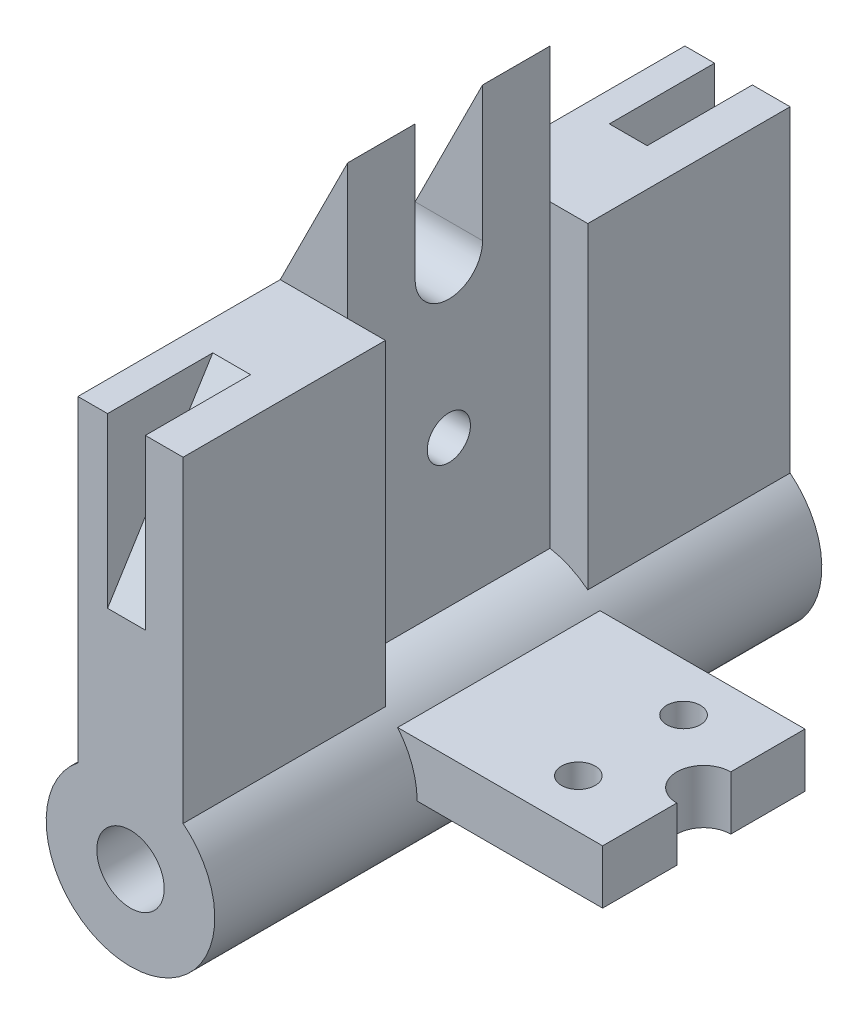
ISO-10303-21;
HEADER;
FILE_DESCRIPTION(('STEP AP214'),'2;1');
FILE_NAME('part.step','',(''),(''),'','','');
FILE_SCHEMA(('AUTOMOTIVE_DESIGN { 1 0 10303 214 1 1 1 1 }'));
ENDSEC;
DATA;
#1=APPLICATION_CONTEXT('core data for automotive mechanical design processes');
#2=APPLICATION_PROTOCOL_DEFINITION('international standard','automotive_design',2000,#1);
#3=PRODUCT_CONTEXT('',#1,'mechanical');
#4=PRODUCT('Part','Part','',(#3));
#5=PRODUCT_RELATED_PRODUCT_CATEGORY('part','',(#4));
#6=PRODUCT_DEFINITION_FORMATION('','',#4);
#7=PRODUCT_DEFINITION_CONTEXT('part definition',#1,'design');
#8=PRODUCT_DEFINITION('design','',#6,#7);
#9=PRODUCT_DEFINITION_SHAPE('','',#8);
#10=(LENGTH_UNIT() NAMED_UNIT(*) SI_UNIT(.MILLI.,.METRE.));
#11=(NAMED_UNIT(*) PLANE_ANGLE_UNIT() SI_UNIT($,.RADIAN.));
#12=(NAMED_UNIT(*) SI_UNIT($,.STERADIAN.) SOLID_ANGLE_UNIT());
#13=UNCERTAINTY_MEASURE_WITH_UNIT(LENGTH_MEASURE(1.E-05),#10,'distance_accuracy_value','');
#14=(GEOMETRIC_REPRESENTATION_CONTEXT(3) GLOBAL_UNCERTAINTY_ASSIGNED_CONTEXT((#13)) GLOBAL_UNIT_ASSIGNED_CONTEXT((#10,
#11,#12)) REPRESENTATION_CONTEXT('',''));
#15=CARTESIAN_POINT('',(0.,0.,0.));
#16=DIRECTION('',(0.,0.,1.));
#17=DIRECTION('',(1.,0.,0.));
#18=AXIS2_PLACEMENT_3D('',#15,#16,#17);
#19=CARTESIAN_POINT('',(50.8,0.,19.05));
#20=DIRECTION('',(-1.,0.,0.));
#21=DIRECTION('',(0.,0.,1.));
#22=AXIS2_PLACEMENT_3D('',#19,#20,#21);
#23=PLANE('',#22);
#24=DIRECTION('',(0.,0.,-1.));
#25=VECTOR('',#24,1.);
#26=CARTESIAN_POINT('',(50.8,0.,19.05));
#27=LINE('',#26,#25);
#28=CARTESIAN_POINT('',(50.8,0.,19.05));
#29=VERTEX_POINT('',#28);
#30=CARTESIAN_POINT('',(50.8,0.,5.08000000000001));
#31=VERTEX_POINT('',#30);
#32=EDGE_CURVE('E211',#29,#31,#27,.T.);
#33=ORIENTED_EDGE('',*,*,#32,.T.);
#34=DIRECTION('',(0.,1.,0.));
#35=VECTOR('',#34,1.);
#36=CARTESIAN_POINT('',(50.8,-15.875,5.08000000000001));
#37=LINE('',#36,#35);
#38=CARTESIAN_POINT('',(50.8,10.16,5.08000000000001));
#39=VERTEX_POINT('',#38);
#40=EDGE_CURVE('E199',#31,#39,#37,.T.);
#41=ORIENTED_EDGE('',*,*,#40,.T.);
#42=DIRECTION('',(0.,0.,-1.));
#43=VECTOR('',#42,1.);
#44=CARTESIAN_POINT('',(50.8,10.16,19.05));
#45=LINE('',#44,#43);
#46=CARTESIAN_POINT('',(50.8,10.16,19.05));
#47=VERTEX_POINT('',#46);
#48=EDGE_CURVE('E208',#47,#39,#45,.T.);
#49=ORIENTED_EDGE('',*,*,#48,.F.);
#50=DIRECTION('',(0.,1.,0.));
#51=VECTOR('',#50,1.);
#52=CARTESIAN_POINT('',(50.8,0.,19.05));
#53=LINE('',#52,#51);
#54=EDGE_CURVE('E250',#29,#47,#53,.T.);
#55=ORIENTED_EDGE('',*,*,#54,.F.);
#56=EDGE_LOOP('',(#33,#41,#49,#55));
#57=FACE_BOUND('',#56,.T.);
#58=ADVANCED_FACE('F34',(#57),#23,.F.);
#59=CARTESIAN_POINT('',(2.794,0.,19.05));
#60=DIRECTION('',(-1.,0.,0.));
#61=DIRECTION('',(0.,0.,1.));
#62=AXIS2_PLACEMENT_3D('',#59,#60,#61);
#63=PLANE('',#62);
#64=CARTESIAN_POINT('',(2.794,43.18,0.));
#65=DIRECTION('',(1.,0.,0.));
#66=DIRECTION('',(0.,0.,-1.));
#67=AXIS2_PLACEMENT_3D('',#64,#65,#66);
#68=CIRCLE('',#67,4.064);
#69=CARTESIAN_POINT('',(2.794,43.18,-4.064));
#70=VERTEX_POINT('',#69);
#71=EDGE_CURVE('E318',#70,#70,#68,.T.);
#72=ORIENTED_EDGE('',*,*,#71,.F.);
#73=EDGE_LOOP('',(#72));
#74=FACE_BOUND('',#73,.T.);
#75=DIRECTION('',(0.,1.,0.));
#76=VECTOR('',#75,1.);
#77=CARTESIAN_POINT('',(2.794,0.,6.35));
#78=LINE('',#77,#76);
#79=CARTESIAN_POINT('',(2.794,72.136,6.35));
#80=VERTEX_POINT('',#79);
#81=CARTESIAN_POINT('',(2.794,97.536,6.35));
#82=VERTEX_POINT('',#81);
#83=EDGE_CURVE('E317',#80,#82,#78,.T.);
#84=ORIENTED_EDGE('',*,*,#83,.T.);
#85=DIRECTION('',(0.,0.,-1.));
#86=VECTOR('',#85,1.);
#87=CARTESIAN_POINT('',(2.794,97.536,19.05));
#88=LINE('',#87,#86);
#89=CARTESIAN_POINT('',(2.794,97.536,19.05));
#90=VERTEX_POINT('',#89);
#91=EDGE_CURVE('E235',#90,#82,#88,.T.);
#92=ORIENTED_EDGE('',*,*,#91,.F.);
#93=DIRECTION('',(0.,1.,0.));
#94=VECTOR('',#93,1.);
#95=CARTESIAN_POINT('',(2.794,0.,19.05));
#96=LINE('',#95,#94);
#97=CARTESIAN_POINT('',(2.794,72.136,19.05));
#98=VERTEX_POINT('',#97);
#99=EDGE_CURVE('E266',#98,#90,#96,.T.);
#100=ORIENTED_EDGE('',*,*,#99,.F.);
#101=CARTESIAN_POINT('',(2.79400000000001,15.6271938939785,19.05));
#102=VERTEX_POINT('',#101);
#103=EDGE_CURVE('E412',#102,#98,#96,.T.);
#104=ORIENTED_EDGE('',*,*,#103,.F.);
#105=DIRECTION('',(0.,0.,-1.));
#106=VECTOR('',#105,1.);
#107=CARTESIAN_POINT('',(2.79400000000001,15.6271938939785,19.05));
#108=LINE('',#107,#106);
#109=CARTESIAN_POINT('',(2.79400000000001,15.6271938939785,-19.05));
#110=VERTEX_POINT('',#109);
#111=EDGE_CURVE('E224',#102,#110,#108,.T.);
#112=ORIENTED_EDGE('',*,*,#111,.T.);
#113=DIRECTION('',(0.,1.,0.));
#114=VECTOR('',#113,1.);
#115=CARTESIAN_POINT('',(2.794,0.,-19.05));
#116=LINE('',#115,#114);
#117=CARTESIAN_POINT('',(2.794,72.136,-19.05));
#118=VERTEX_POINT('',#117);
#119=EDGE_CURVE('E253',#110,#118,#116,.T.);
#120=ORIENTED_EDGE('',*,*,#119,.T.);
#121=CARTESIAN_POINT('',(2.794,97.536,-19.05));
#122=VERTEX_POINT('',#121);
#123=EDGE_CURVE('E256',#118,#122,#116,.T.);
#124=ORIENTED_EDGE('',*,*,#123,.T.);
#125=CARTESIAN_POINT('',(2.794,97.536,-6.35));
#126=VERTEX_POINT('',#125);
#127=EDGE_CURVE('E234',#126,#122,#88,.T.);
#128=ORIENTED_EDGE('',*,*,#127,.F.);
#129=DIRECTION('',(0.,1.,0.));
#130=VECTOR('',#129,1.);
#131=CARTESIAN_POINT('',(2.794,0.,-6.35));
#132=LINE('',#131,#130);
#133=CARTESIAN_POINT('',(2.794,72.136,-6.35));
#134=VERTEX_POINT('',#133);
#135=EDGE_CURVE('E335',#134,#126,#132,.T.);
#136=ORIENTED_EDGE('',*,*,#135,.F.);
#137=CARTESIAN_POINT('',(2.794,72.136,0.));
#138=DIRECTION('',(1.,0.,0.));
#139=DIRECTION('',(0.,0.,-1.));
#140=AXIS2_PLACEMENT_3D('',#137,#138,#139);
#141=CIRCLE('',#140,6.35);
#142=EDGE_CURVE('E322',#80,#134,#141,.T.);
#143=ORIENTED_EDGE('',*,*,#142,.F.);
#144=EDGE_LOOP('',(#84,#92,#100,#104,#112,#120,#124,#128,#136,#143));
#145=FACE_BOUND('',#144,.T.);
#146=ADVANCED_FACE('F36',(#74,#145),#63,.F.);
#147=CARTESIAN_POINT('',(-36.7792,18.3896,19.05));
#148=DIRECTION('',(0.894427190999916,-0.447213595499958,0.));
#149=DIRECTION('',(0.447213595499958,0.894427190999916,0.));
#150=AXIS2_PLACEMENT_3D('',#147,#148,#149);
#151=PLANE('',#150);
#152=DIRECTION('',(0.447213595499958,0.894427190999916,0.));
#153=VECTOR('',#152,1.);
#154=CARTESIAN_POINT('',(-36.7792,18.3896,6.35));
#155=LINE('',#154,#153);
#156=CARTESIAN_POINT('',(-9.906,72.136,6.35));
#157=VERTEX_POINT('',#156);
#158=EDGE_CURVE('E42',#157,#82,#155,.T.);
#159=ORIENTED_EDGE('',*,*,#158,.F.);
#160=DIRECTION('',(0.,0.,-1.));
#161=VECTOR('',#160,1.);
#162=CARTESIAN_POINT('',(-9.906,72.136,19.05));
#163=LINE('',#162,#161);
#164=CARTESIAN_POINT('',(-9.906,72.136,19.05));
#165=VERTEX_POINT('',#164);
#166=EDGE_CURVE('E231',#165,#157,#163,.T.);
#167=ORIENTED_EDGE('',*,*,#166,.F.);
#168=DIRECTION('',(-0.447213595499958,-0.894427190999916,0.));
#169=VECTOR('',#168,1.);
#170=CARTESIAN_POINT('',(-36.7792,18.3896,19.05));
#171=LINE('',#170,#169);
#172=EDGE_CURVE('E248',#90,#165,#171,.T.);
#173=ORIENTED_EDGE('',*,*,#172,.F.);
#174=ORIENTED_EDGE('',*,*,#91,.T.);
#175=EDGE_LOOP('',(#159,#167,#173,#174));
#176=FACE_BOUND('',#175,.T.);
#177=ADVANCED_FACE('F427',(#176),#151,.F.);
#178=CARTESIAN_POINT('',(0.,72.136,-57.15));
#179=DIRECTION('',(0.,-1.,0.));
#180=DIRECTION('',(0.,0.,-1.));
#181=AXIS2_PLACEMENT_3D('',#178,#179,#180);
#182=PLANE('',#181);
#183=DIRECTION('',(0.,0.,1.));
#184=VECTOR('',#183,1.);
#185=CARTESIAN_POINT('',(2.794,72.136,-37.338));
#186=LINE('',#185,#184);
#187=CARTESIAN_POINT('',(2.794,72.136,-57.15));
#188=VERTEX_POINT('',#187);
#189=CARTESIAN_POINT('',(2.794,72.136,-37.338));
#190=VERTEX_POINT('',#189);
#191=EDGE_CURVE('E346',#188,#190,#186,.T.);
#192=ORIENTED_EDGE('',*,*,#191,.T.);
#193=DIRECTION('',(-1.,0.,0.));
#194=VECTOR('',#193,1.);
#195=CARTESIAN_POINT('',(-4.318,72.136,-37.338));
#196=LINE('',#195,#194);
#197=CARTESIAN_POINT('',(-4.318,72.136,-37.338));
#198=VERTEX_POINT('',#197);
#199=EDGE_CURVE('E343',#190,#198,#196,.T.);
#200=ORIENTED_EDGE('',*,*,#199,.T.);
#201=DIRECTION('',(0.,0.,-1.));
#202=VECTOR('',#201,1.);
#203=CARTESIAN_POINT('',(-4.318,72.136,-57.15));
#204=LINE('',#203,#202);
#205=CARTESIAN_POINT('',(-4.318,72.136,-57.15));
#206=VERTEX_POINT('',#205);
#207=EDGE_CURVE('E339',#198,#206,#204,.T.);
#208=ORIENTED_EDGE('',*,*,#207,.T.);
#209=DIRECTION('',(1.,0.,0.));
#210=VECTOR('',#209,1.);
#211=CARTESIAN_POINT('',(0.,72.136,-57.15));
#212=LINE('',#211,#210);
#213=CARTESIAN_POINT('',(-9.906,72.136,-57.15));
#214=VERTEX_POINT('',#213);
#215=EDGE_CURVE('E375',#214,#206,#212,.T.);
#216=ORIENTED_EDGE('',*,*,#215,.F.);
#217=DIRECTION('',(0.,0.,1.));
#218=VECTOR('',#217,1.);
#219=CARTESIAN_POINT('',(-9.906,72.136,-57.15));
#220=LINE('',#219,#218);
#221=CARTESIAN_POINT('',(-9.906,72.136,-19.05));
#222=VERTEX_POINT('',#221);
#223=EDGE_CURVE('E382',#214,#222,#220,.T.);
#224=ORIENTED_EDGE('',*,*,#223,.T.);
#225=DIRECTION('',(1.,0.,0.));
#226=VECTOR('',#225,1.);
#227=CARTESIAN_POINT('',(0.,72.136,-19.05));
#228=LINE('',#227,#226);
#229=EDGE_CURVE('E368',#222,#118,#228,.T.);
#230=ORIENTED_EDGE('',*,*,#229,.T.);
#231=CARTESIAN_POINT('',(9.906,72.136,-19.05));
#232=VERTEX_POINT('',#231);
#233=EDGE_CURVE('E293',#118,#232,#228,.T.);
#234=ORIENTED_EDGE('',*,*,#233,.T.);
#235=DIRECTION('',(0.,0.,1.));
#236=VECTOR('',#235,1.);
#237=CARTESIAN_POINT('',(9.906,72.136,-57.15));
#238=LINE('',#237,#236);
#239=CARTESIAN_POINT('',(9.906,72.136,-57.15));
#240=VERTEX_POINT('',#239);
#241=EDGE_CURVE('E286',#240,#232,#238,.T.);
#242=ORIENTED_EDGE('',*,*,#241,.F.);
#243=EDGE_CURVE('E374',#188,#240,#212,.T.);
#244=ORIENTED_EDGE('',*,*,#243,.F.);
#245=EDGE_LOOP('',(#192,#200,#208,#216,#224,#230,#234,#242,#244));
#246=FACE_BOUND('',#245,.T.);
#247=ADVANCED_FACE('F520',(#246),#182,.F.);
#248=CARTESIAN_POINT('',(0.,0.,-57.15));
#249=DIRECTION('',(0.,0.,1.));
#250=DIRECTION('',(1.,0.,0.));
#251=AXIS2_PLACEMENT_3D('',#248,#249,#250);
#252=PLANE('',#251);
#253=CARTESIAN_POINT('',(0.,0.,-57.15));
#254=DIRECTION('',(0.,0.,1.));
#255=DIRECTION('',(1.,0.,0.));
#256=AXIS2_PLACEMENT_3D('',#253,#254,#255);
#257=CIRCLE('',#256,6.35);
#258=CARTESIAN_POINT('',(-6.35,0.,-57.15));
#259=VERTEX_POINT('',#258);
#260=EDGE_CURVE('E287',#259,#259,#257,.T.);
#261=ORIENTED_EDGE('',*,*,#260,.T.);
#262=EDGE_LOOP('',(#261));
#263=FACE_BOUND('',#262,.T.);
#264=DIRECTION('',(0.,-1.,0.));
#265=VECTOR('',#264,1.);
#266=CARTESIAN_POINT('',(2.79399999999999,0.,-57.15));
#267=LINE('',#266,#265);
#268=CARTESIAN_POINT('',(2.794,40.386,-57.15));
#269=VERTEX_POINT('',#268);
#270=EDGE_CURVE('E308',#188,#269,#267,.T.);
#271=ORIENTED_EDGE('',*,*,#270,.F.);
#272=ORIENTED_EDGE('',*,*,#243,.T.);
#273=DIRECTION('',(0.,1.,0.));
#274=VECTOR('',#273,1.);
#275=CARTESIAN_POINT('',(9.906,0.,-57.15));
#276=LINE('',#275,#274);
#277=CARTESIAN_POINT('',(9.906,12.4051114061906,-57.15));
#278=VERTEX_POINT('',#277);
#279=EDGE_CURVE('E371',#278,#240,#276,.T.);
#280=ORIENTED_EDGE('',*,*,#279,.F.);
#281=CARTESIAN_POINT('',(0.,0.,-57.15));
#282=DIRECTION('',(0.,0.,1.));
#283=DIRECTION('',(1.,0.,0.));
#284=AXIS2_PLACEMENT_3D('',#281,#282,#283);
#285=CIRCLE('',#284,15.875);
#286=CARTESIAN_POINT('',(-9.906,12.4051114061906,-57.15));
#287=VERTEX_POINT('',#286);
#288=EDGE_CURVE('E367',#287,#278,#285,.T.);
#289=ORIENTED_EDGE('',*,*,#288,.F.);
#290=DIRECTION('',(0.,1.,0.));
#291=VECTOR('',#290,1.);
#292=CARTESIAN_POINT('',(-9.906,0.,-57.15));
#293=LINE('',#292,#291);
#294=EDGE_CURVE('E364',#287,#214,#293,.T.);
#295=ORIENTED_EDGE('',*,*,#294,.T.);
#296=ORIENTED_EDGE('',*,*,#215,.T.);
#297=DIRECTION('',(0.,1.,0.));
#298=VECTOR('',#297,1.);
#299=CARTESIAN_POINT('',(-4.318,0.,-57.15));
#300=LINE('',#299,#298);
#301=CARTESIAN_POINT('',(-4.318,40.386,-57.15));
#302=VERTEX_POINT('',#301);
#303=EDGE_CURVE('E303',#302,#206,#300,.T.);
#304=ORIENTED_EDGE('',*,*,#303,.F.);
#305=DIRECTION('',(-1.,0.,0.));
#306=VECTOR('',#305,1.);
#307=CARTESIAN_POINT('',(0.,40.386,-57.15));
#308=LINE('',#307,#306);
#309=EDGE_CURVE('E305',#269,#302,#308,.T.);
#310=ORIENTED_EDGE('',*,*,#309,.F.);
#311=EDGE_LOOP('',(#271,#272,#280,#289,#295,#296,#304,#310));
#312=FACE_BOUND('',#311,.T.);
#313=ADVANCED_FACE('F524',(#263,#312),#252,.F.);
#314=CARTESIAN_POINT('',(0.,0.,-19.05));
#315=DIRECTION('',(0.,0.,1.));
#316=DIRECTION('',(1.,0.,0.));
#317=AXIS2_PLACEMENT_3D('',#314,#315,#316);
#318=PLANE('',#317);
#319=ORIENTED_EDGE('',*,*,#229,.F.);
#320=DIRECTION('',(-0.447213595499958,-0.894427190999916,0.));
#321=VECTOR('',#320,1.);
#322=CARTESIAN_POINT('',(-36.7792,18.3896,-19.05));
#323=LINE('',#322,#321);
#324=EDGE_CURVE('E255',#122,#222,#323,.T.);
#325=ORIENTED_EDGE('',*,*,#324,.F.);
#326=ORIENTED_EDGE('',*,*,#123,.F.);
#327=EDGE_LOOP('',(#319,#325,#326));
#328=FACE_BOUND('',#327,.T.);
#329=ADVANCED_FACE('F517',(#328),#318,.F.);
#330=CARTESIAN_POINT('',(0.,0.,19.05));
#331=DIRECTION('',(0.,0.,1.));
#332=DIRECTION('',(1.,0.,0.));
#333=AXIS2_PLACEMENT_3D('',#330,#331,#332);
#334=PLANE('',#333);
#335=ORIENTED_EDGE('',*,*,#172,.T.);
#336=DIRECTION('',(1.,0.,0.));
#337=VECTOR('',#336,1.);
#338=CARTESIAN_POINT('',(0.,72.136,19.05));
#339=LINE('',#338,#337);
#340=EDGE_CURVE('E392',#165,#98,#339,.T.);
#341=ORIENTED_EDGE('',*,*,#340,.T.);
#342=ORIENTED_EDGE('',*,*,#99,.T.);
#343=EDGE_LOOP('',(#335,#341,#342));
#344=FACE_BOUND('',#343,.T.);
#345=ADVANCED_FACE('F420',(#344),#334,.T.);
#346=CARTESIAN_POINT('',(-9.906,72.136,-6.35));
#347=VERTEX_POINT('',#346);
#348=EDGE_CURVE('E230',#347,#222,#163,.T.);
#349=ORIENTED_EDGE('',*,*,#348,.F.);
#350=DIRECTION('',(0.447213595499958,0.894427190999916,0.));
#351=VECTOR('',#350,1.);
#352=CARTESIAN_POINT('',(-36.7792,18.3896,-6.35));
#353=LINE('',#352,#351);
#354=EDGE_CURVE('E312',#347,#126,#353,.T.);
#355=ORIENTED_EDGE('',*,*,#354,.T.);
#356=ORIENTED_EDGE('',*,*,#127,.T.);
#357=ORIENTED_EDGE('',*,*,#324,.T.);
#358=EDGE_LOOP('',(#349,#355,#356,#357));
#359=FACE_BOUND('',#358,.T.);
#360=ADVANCED_FACE('F510',(#359),#151,.F.);
#361=CARTESIAN_POINT('',(-9.906,0.,19.05));
#362=DIRECTION('',(-1.,0.,0.));
#363=DIRECTION('',(0.,0.,1.));
#364=AXIS2_PLACEMENT_3D('',#361,#362,#363);
#365=PLANE('',#364);
#366=CARTESIAN_POINT('',(-9.906,43.18,0.));
#367=DIRECTION('',(-1.,0.,0.));
#368=DIRECTION('',(0.,0.,1.));
#369=AXIS2_PLACEMENT_3D('',#366,#367,#368);
#370=CIRCLE('',#369,4.064);
#371=CARTESIAN_POINT('',(-9.906,43.18,4.064));
#372=VERTEX_POINT('',#371);
#373=EDGE_CURVE('E315',#372,#372,#370,.T.);
#374=ORIENTED_EDGE('',*,*,#373,.F.);
#375=EDGE_LOOP('',(#374));
#376=FACE_BOUND('',#375,.T.);
#377=CARTESIAN_POINT('',(-9.906,72.136,0.));
#378=DIRECTION('',(-1.,0.,0.));
#379=DIRECTION('',(0.,0.,1.));
#380=AXIS2_PLACEMENT_3D('',#377,#378,#379);
#381=CIRCLE('',#380,6.35);
#382=EDGE_CURVE('E310',#347,#157,#381,.T.);
#383=ORIENTED_EDGE('',*,*,#382,.F.);
#384=ORIENTED_EDGE('',*,*,#348,.T.);
#385=ORIENTED_EDGE('',*,*,#223,.F.);
#386=ORIENTED_EDGE('',*,*,#294,.F.);
#387=DIRECTION('',(0.,0.,-1.));
#388=VECTOR('',#387,1.);
#389=CARTESIAN_POINT('',(-9.906,12.4051114061906,19.05));
#390=LINE('',#389,#388);
#391=CARTESIAN_POINT('',(-9.906,12.4051114061906,57.15));
#392=VERTEX_POINT('',#391);
#393=EDGE_CURVE('E228',#392,#287,#390,.T.);
#394=ORIENTED_EDGE('',*,*,#393,.F.);
#395=DIRECTION('',(0.,1.,0.));
#396=VECTOR('',#395,1.);
#397=CARTESIAN_POINT('',(-9.906,0.,57.15));
#398=LINE('',#397,#396);
#399=CARTESIAN_POINT('',(-9.906,72.136,57.15));
#400=VERTEX_POINT('',#399);
#401=EDGE_CURVE('E388',#392,#400,#398,.T.);
#402=ORIENTED_EDGE('',*,*,#401,.T.);
#403=DIRECTION('',(0.,0.,-1.));
#404=VECTOR('',#403,1.);
#405=CARTESIAN_POINT('',(-9.906,72.136,57.15));
#406=LINE('',#405,#404);
#407=EDGE_CURVE('E404',#400,#165,#406,.T.);
#408=ORIENTED_EDGE('',*,*,#407,.T.);
#409=ORIENTED_EDGE('',*,*,#166,.T.);
#410=EDGE_LOOP('',(#383,#384,#385,#386,#394,#402,#408,#409));
#411=FACE_BOUND('',#410,.T.);
#412=ADVANCED_FACE('F436',(#376,#411),#365,.T.);
#413=CARTESIAN_POINT('',(0.,0.,19.05));
#414=DIRECTION('',(0.,1.,0.));
#415=DIRECTION('',(-1.,0.,0.));
#416=AXIS2_PLACEMENT_3D('',#413,#414,#415);
#417=PLANE('',#416);
#418=CARTESIAN_POINT('',(37.084,0.,-9.906));
#419=DIRECTION('',(0.,1.,0.));
#420=DIRECTION('',(-1.,0.,0.));
#421=AXIS2_PLACEMENT_3D('',#418,#419,#420);
#422=CIRCLE('',#421,3.175);
#423=CARTESIAN_POINT('',(33.909,0.,-9.906));
#424=VERTEX_POINT('',#423);
#425=EDGE_CURVE('E477',#424,#424,#422,.T.);
#426=ORIENTED_EDGE('',*,*,#425,.T.);
#427=EDGE_LOOP('',(#426));
#428=FACE_BOUND('',#427,.T.);
#429=CARTESIAN_POINT('',(37.084,0.,9.906));
#430=DIRECTION('',(0.,1.,0.));
#431=DIRECTION('',(-1.,0.,0.));
#432=AXIS2_PLACEMENT_3D('',#429,#430,#431);
#433=CIRCLE('',#432,3.175);
#434=CARTESIAN_POINT('',(33.909,0.,9.906));
#435=VERTEX_POINT('',#434);
#436=EDGE_CURVE('E325',#435,#435,#433,.T.);
#437=ORIENTED_EDGE('',*,*,#436,.T.);
#438=EDGE_LOOP('',(#437));
#439=FACE_BOUND('',#438,.T.);
#440=CARTESIAN_POINT('',(50.8,0.,-5.08));
#441=VERTEX_POINT('',#440);
#442=CARTESIAN_POINT('',(50.8,0.,-19.05));
#443=VERTEX_POINT('',#442);
#444=EDGE_CURVE('E218',#441,#443,#27,.T.);
#445=ORIENTED_EDGE('',*,*,#444,.F.);
#446=CARTESIAN_POINT('',(50.8,0.,0.));
#447=DIRECTION('',(0.,1.,0.));
#448=DIRECTION('',(-1.,0.,0.));
#449=AXIS2_PLACEMENT_3D('',#446,#447,#448);
#450=CIRCLE('',#449,5.08);
#451=EDGE_CURVE('E213',#441,#31,#450,.T.);
#452=ORIENTED_EDGE('',*,*,#451,.T.);
#453=ORIENTED_EDGE('',*,*,#32,.F.);
#454=DIRECTION('',(1.,0.,0.));
#455=VECTOR('',#454,1.);
#456=CARTESIAN_POINT('',(0.,0.,19.05));
#457=LINE('',#456,#455);
#458=CARTESIAN_POINT('',(15.875,0.,19.05));
#459=VERTEX_POINT('',#458);
#460=EDGE_CURVE('E252',#459,#29,#457,.T.);
#461=ORIENTED_EDGE('',*,*,#460,.F.);
#462=DIRECTION('',(0.,0.,-1.));
#463=VECTOR('',#462,1.);
#464=CARTESIAN_POINT('',(15.875,0.,19.05));
#465=LINE('',#464,#463);
#466=CARTESIAN_POINT('',(15.875,0.,-19.05));
#467=VERTEX_POINT('',#466);
#468=EDGE_CURVE('E227',#459,#467,#465,.T.);
#469=ORIENTED_EDGE('',*,*,#468,.T.);
#470=DIRECTION('',(1.,0.,0.));
#471=VECTOR('',#470,1.);
#472=CARTESIAN_POINT('',(0.,0.,-19.05));
#473=LINE('',#472,#471);
#474=EDGE_CURVE('E259',#467,#443,#473,.T.);
#475=ORIENTED_EDGE('',*,*,#474,.T.);
#476=EDGE_LOOP('',(#445,#452,#453,#461,#469,#475));
#477=FACE_BOUND('',#476,.T.);
#478=ADVANCED_FACE('F471',(#428,#439,#477),#417,.F.);
#479=CARTESIAN_POINT('',(50.8,10.16,-5.08));
#480=VERTEX_POINT('',#479);
#481=CARTESIAN_POINT('',(50.8,10.16,-19.05));
#482=VERTEX_POINT('',#481);
#483=EDGE_CURVE('E219',#480,#482,#45,.T.);
#484=ORIENTED_EDGE('',*,*,#483,.F.);
#485=DIRECTION('',(0.,1.,0.));
#486=VECTOR('',#485,1.);
#487=CARTESIAN_POINT('',(50.8,-15.875,-5.08));
#488=LINE('',#487,#486);
#489=EDGE_CURVE('E49',#480,#441,#488,.F.);
#490=ORIENTED_EDGE('',*,*,#489,.T.);
#491=ORIENTED_EDGE('',*,*,#444,.T.);
#492=DIRECTION('',(0.,1.,0.));
#493=VECTOR('',#492,1.);
#494=CARTESIAN_POINT('',(50.8,0.,-19.05));
#495=LINE('',#494,#493);
#496=EDGE_CURVE('E261',#443,#482,#495,.T.);
#497=ORIENTED_EDGE('',*,*,#496,.T.);
#498=EDGE_LOOP('',(#484,#490,#491,#497));
#499=FACE_BOUND('',#498,.T.);
#500=ADVANCED_FACE('F487',(#499),#23,.F.);
#501=CARTESIAN_POINT('',(0.,10.16,19.05));
#502=DIRECTION('',(0.,-1.,0.));
#503=DIRECTION('',(1.,0.,0.));
#504=AXIS2_PLACEMENT_3D('',#501,#502,#503);
#505=PLANE('',#504);
#506=CARTESIAN_POINT('',(37.084,10.16,-9.906));
#507=DIRECTION('',(0.,1.,0.));
#508=DIRECTION('',(-1.,0.,0.));
#509=AXIS2_PLACEMENT_3D('',#506,#507,#508);
#510=CIRCLE('',#509,3.175);
#511=CARTESIAN_POINT('',(33.909,10.16,-9.906));
#512=VERTEX_POINT('',#511);
#513=EDGE_CURVE('E212',#512,#512,#510,.T.);
#514=ORIENTED_EDGE('',*,*,#513,.F.);
#515=EDGE_LOOP('',(#514));
#516=FACE_BOUND('',#515,.T.);
#517=CARTESIAN_POINT('',(37.084,10.16,9.906));
#518=DIRECTION('',(0.,1.,0.));
#519=DIRECTION('',(-1.,0.,0.));
#520=AXIS2_PLACEMENT_3D('',#517,#518,#519);
#521=CIRCLE('',#520,3.175);
#522=CARTESIAN_POINT('',(33.909,10.16,9.906));
#523=VERTEX_POINT('',#522);
#524=EDGE_CURVE('E330',#523,#523,#521,.T.);
#525=ORIENTED_EDGE('',*,*,#524,.F.);
#526=EDGE_LOOP('',(#525));
#527=FACE_BOUND('',#526,.T.);
#528=ORIENTED_EDGE('',*,*,#48,.T.);
#529=CARTESIAN_POINT('',(50.8,10.16,0.));
#530=DIRECTION('',(0.,-1.,0.));
#531=DIRECTION('',(1.,0.,0.));
#532=AXIS2_PLACEMENT_3D('',#529,#530,#531);
#533=CIRCLE('',#532,5.08);
#534=EDGE_CURVE('E11',#39,#480,#533,.T.);
#535=ORIENTED_EDGE('',*,*,#534,.T.);
#536=ORIENTED_EDGE('',*,*,#483,.T.);
#537=DIRECTION('',(-1.,0.,0.));
#538=VECTOR('',#537,1.);
#539=CARTESIAN_POINT('',(0.,10.16,-19.05));
#540=LINE('',#539,#538);
#541=CARTESIAN_POINT('',(12.1979516723096,10.16,-19.05));
#542=VERTEX_POINT('',#541);
#543=EDGE_CURVE('E267',#482,#542,#540,.T.);
#544=ORIENTED_EDGE('',*,*,#543,.T.);
#545=DIRECTION('',(0.,0.,-1.));
#546=VECTOR('',#545,1.);
#547=CARTESIAN_POINT('',(12.1979516723096,10.16,19.05));
#548=LINE('',#547,#546);
#549=CARTESIAN_POINT('',(12.1979516723096,10.16,19.05));
#550=VERTEX_POINT('',#549);
#551=EDGE_CURVE('E222',#550,#542,#548,.T.);
#552=ORIENTED_EDGE('',*,*,#551,.F.);
#553=DIRECTION('',(-1.,0.,0.));
#554=VECTOR('',#553,1.);
#555=CARTESIAN_POINT('',(0.,10.16,19.05));
#556=LINE('',#555,#554);
#557=EDGE_CURVE('E217',#47,#550,#556,.T.);
#558=ORIENTED_EDGE('',*,*,#557,.F.);
#559=EDGE_LOOP('',(#528,#535,#536,#544,#552,#558));
#560=FACE_BOUND('',#559,.T.);
#561=ADVANCED_FACE('F215',(#516,#527,#560),#505,.F.);
#562=CARTESIAN_POINT('',(0.,0.,19.05));
#563=DIRECTION('',(0.,0.,-1.));
#564=DIRECTION('',(-1.,0.,0.));
#565=AXIS2_PLACEMENT_3D('',#562,#563,#564);
#566=CYLINDRICAL_SURFACE('',#565,15.875);
#567=CARTESIAN_POINT('',(0.,0.,-19.05));
#568=DIRECTION('',(0.,0.,1.));
#569=DIRECTION('',(1.,0.,0.));
#570=AXIS2_PLACEMENT_3D('',#567,#568,#569);
#571=CIRCLE('',#570,15.875);
#572=EDGE_CURVE('E272',#467,#542,#571,.T.);
#573=ORIENTED_EDGE('',*,*,#572,.F.);
#574=ORIENTED_EDGE('',*,*,#468,.F.);
#575=CARTESIAN_POINT('',(0.,0.,19.05));
#576=DIRECTION('',(0.,0.,1.));
#577=DIRECTION('',(1.,0.,0.));
#578=AXIS2_PLACEMENT_3D('',#575,#576,#577);
#579=CIRCLE('',#578,15.875);
#580=EDGE_CURVE('E238',#459,#550,#579,.T.);
#581=ORIENTED_EDGE('',*,*,#580,.T.);
#582=ORIENTED_EDGE('',*,*,#551,.T.);
#583=EDGE_LOOP('',(#573,#574,#581,#582));
#584=FACE_BOUND('',#583,.T.);
#585=ORIENTED_EDGE('',*,*,#393,.T.);
#586=ORIENTED_EDGE('',*,*,#288,.T.);
#587=DIRECTION('',(0.,0.,1.));
#588=VECTOR('',#587,1.);
#589=CARTESIAN_POINT('',(9.906,12.4051114061906,-57.15));
#590=LINE('',#589,#588);
#591=CARTESIAN_POINT('',(9.906,12.4051114061906,-19.05));
#592=VERTEX_POINT('',#591);
#593=EDGE_CURVE('E283',#278,#592,#590,.T.);
#594=ORIENTED_EDGE('',*,*,#593,.T.);
#595=CARTESIAN_POINT('',(0.,0.,-19.05));
#596=DIRECTION('',(0.,0.,1.));
#597=DIRECTION('',(1.,0.,0.));
#598=AXIS2_PLACEMENT_3D('',#595,#596,#597);
#599=CIRCLE('',#598,15.875);
#600=EDGE_CURVE('E263',#592,#110,#599,.T.);
#601=ORIENTED_EDGE('',*,*,#600,.T.);
#602=ORIENTED_EDGE('',*,*,#111,.F.);
#603=CARTESIAN_POINT('',(0.,0.,19.05));
#604=DIRECTION('',(0.,0.,1.));
#605=DIRECTION('',(1.,0.,0.));
#606=AXIS2_PLACEMENT_3D('',#603,#604,#605);
#607=CIRCLE('',#606,15.875);
#608=CARTESIAN_POINT('',(9.906,12.4051114061906,19.05));
#609=VERTEX_POINT('',#608);
#610=EDGE_CURVE('E239',#609,#102,#607,.T.);
#611=ORIENTED_EDGE('',*,*,#610,.F.);
#612=DIRECTION('',(0.,0.,-1.));
#613=VECTOR('',#612,1.);
#614=CARTESIAN_POINT('',(9.906,12.4051114061906,57.15));
#615=LINE('',#614,#613);
#616=CARTESIAN_POINT('',(9.906,12.4051114061906,57.15));
#617=VERTEX_POINT('',#616);
#618=EDGE_CURVE('E411',#617,#609,#615,.T.);
#619=ORIENTED_EDGE('',*,*,#618,.F.);
#620=CARTESIAN_POINT('',(0.,0.,57.15));
#621=DIRECTION('',(0.,0.,1.));
#622=DIRECTION('',(1.,0.,0.));
#623=AXIS2_PLACEMENT_3D('',#620,#621,#622);
#624=CIRCLE('',#623,15.875);
#625=EDGE_CURVE('E391',#392,#617,#624,.T.);
#626=ORIENTED_EDGE('',*,*,#625,.F.);
#627=EDGE_LOOP('',(#585,#586,#594,#601,#602,#611,#619,#626));
#628=FACE_BOUND('',#627,.T.);
#629=ADVANCED_FACE('F486',(#584,#628),#566,.T.);
#630=CARTESIAN_POINT('',(0.,0.,19.05));
#631=DIRECTION('',(0.,0.,-1.));
#632=DIRECTION('',(-1.,0.,0.));
#633=AXIS2_PLACEMENT_3D('',#630,#631,#632);
#634=CYLINDRICAL_SURFACE('',#633,6.35);
#635=CARTESIAN_POINT('',(0.,0.,57.15));
#636=DIRECTION('',(0.,0.,1.));
#637=DIRECTION('',(1.,0.,0.));
#638=AXIS2_PLACEMENT_3D('',#635,#636,#637);
#639=CIRCLE('',#638,6.35);
#640=CARTESIAN_POINT('',(-6.35,0.,57.15));
#641=VERTEX_POINT('',#640);
#642=EDGE_CURVE('E401',#641,#641,#639,.T.);
#643=CARTESIAN_POINT('',(-6.35,0.,57.15));
#644=CARTESIAN_POINT('',(-6.35,0.,55.959375));
#645=CARTESIAN_POINT('',(-6.35,0.,54.76875));
#646=CARTESIAN_POINT('',(-6.35,0.,52.3875));
#647=CARTESIAN_POINT('',(-6.35,0.,51.196875));
#648=CARTESIAN_POINT('',(-6.35,0.,48.815625));
#649=CARTESIAN_POINT('',(-6.35,0.,47.625));
#650=CARTESIAN_POINT('',(-6.35,0.,45.24375));
#651=CARTESIAN_POINT('',(-6.35,0.,44.053125));
#652=CARTESIAN_POINT('',(-6.35,0.,41.671875));
#653=CARTESIAN_POINT('',(-6.35,0.,40.48125));
#654=CARTESIAN_POINT('',(-6.35,0.,38.1));
#655=CARTESIAN_POINT('',(-6.35,0.,36.909375));
#656=CARTESIAN_POINT('',(-6.35,0.,34.528125));
#657=CARTESIAN_POINT('',(-6.35,0.,33.3375));
#658=CARTESIAN_POINT('',(-6.35,0.,30.95625));
#659=CARTESIAN_POINT('',(-6.35,0.,29.765625));
#660=CARTESIAN_POINT('',(-6.35,0.,27.384375));
#661=CARTESIAN_POINT('',(-6.35,0.,26.19375));
#662=CARTESIAN_POINT('',(-6.35,0.,23.8125));
#663=CARTESIAN_POINT('',(-6.35,0.,22.621875));
#664=CARTESIAN_POINT('',(-6.35,0.,20.240625));
#665=CARTESIAN_POINT('',(-6.35,0.,19.05));
#666=CARTESIAN_POINT('',(-6.35,0.,16.66875));
#667=CARTESIAN_POINT('',(-6.35,0.,15.478125));
#668=CARTESIAN_POINT('',(-6.35,0.,13.096875));
#669=CARTESIAN_POINT('',(-6.35,0.,11.90625));
#670=CARTESIAN_POINT('',(-6.35,0.,9.525));
#671=CARTESIAN_POINT('',(-6.35,0.,8.334375));
#672=CARTESIAN_POINT('',(-6.35,0.,5.953125));
#673=CARTESIAN_POINT('',(-6.35,0.,4.7625));
#674=CARTESIAN_POINT('',(-6.35,0.,2.38125));
#675=CARTESIAN_POINT('',(-6.35,0.,1.190625));
#676=CARTESIAN_POINT('',(-6.35,0.,-1.190625));
#677=CARTESIAN_POINT('',(-6.35,0.,-2.38125));
#678=CARTESIAN_POINT('',(-6.35,0.,-4.7625));
#679=CARTESIAN_POINT('',(-6.35,0.,-5.953125));
#680=CARTESIAN_POINT('',(-6.35,0.,-8.334375));
#681=CARTESIAN_POINT('',(-6.35,0.,-9.525));
#682=CARTESIAN_POINT('',(-6.35,0.,-11.90625));
#683=CARTESIAN_POINT('',(-6.35,0.,-13.096875));
#684=CARTESIAN_POINT('',(-6.35,0.,-15.478125));
#685=CARTESIAN_POINT('',(-6.35,0.,-16.66875));
#686=CARTESIAN_POINT('',(-6.35,0.,-19.05));
#687=CARTESIAN_POINT('',(-6.35,0.,-20.240625));
#688=CARTESIAN_POINT('',(-6.35,0.,-22.621875));
#689=CARTESIAN_POINT('',(-6.35,0.,-23.8125));
#690=CARTESIAN_POINT('',(-6.35,0.,-26.19375));
#691=CARTESIAN_POINT('',(-6.35,0.,-27.384375));
#692=CARTESIAN_POINT('',(-6.35,0.,-29.765625));
#693=CARTESIAN_POINT('',(-6.35,0.,-30.95625));
#694=CARTESIAN_POINT('',(-6.35,0.,-33.3375));
#695=CARTESIAN_POINT('',(-6.35,0.,-34.528125));
#696=CARTESIAN_POINT('',(-6.35,0.,-36.909375));
#697=CARTESIAN_POINT('',(-6.35,0.,-38.1));
#698=CARTESIAN_POINT('',(-6.35,0.,-40.48125));
#699=CARTESIAN_POINT('',(-6.35,0.,-41.671875));
#700=CARTESIAN_POINT('',(-6.35,0.,-44.053125));
#701=CARTESIAN_POINT('',(-6.35,0.,-45.24375));
#702=CARTESIAN_POINT('',(-6.35,0.,-47.625));
#703=CARTESIAN_POINT('',(-6.35,0.,-48.815625));
#704=CARTESIAN_POINT('',(-6.35,0.,-51.196875));
#705=CARTESIAN_POINT('',(-6.35,0.,-52.3875));
#706=CARTESIAN_POINT('',(-6.35,0.,-54.76875));
#707=CARTESIAN_POINT('',(-6.35,0.,-55.959375));
#708=CARTESIAN_POINT('',(-6.35,0.,-57.15));
#709=B_SPLINE_CURVE_WITH_KNOTS('',3,(#643,#644,#645,#646,#647,#648,#649,#650,#651,#652,#653,
#654,#655,#656,#657,#658,#659,#660,#661,#662,#663,#664,#665,#666,#667,#668,#669,#670,#671,#672,
#673,#674,#675,#676,#677,#678,#679,#680,#681,#682,#683,#684,#685,#686,#687,#688,#689,#690,#691,
#692,#693,#694,#695,#696,#697,#698,#699,#700,#701,#702,#703,#704,#705,#706,#707,#708),
.UNSPECIFIED.,.F.,.F.,(4,2,2,2,2,2,2,2,2,2,2,2,2,2,2,2,2,2,2,2,2,2,2,2,2,2,2,2,2,2,2,2,4),(0.,
3.571875,7.14375,10.715625,14.2875,17.859375,21.43125,25.003125,28.575,32.146875,35.71875,
39.290625,42.8625,46.434375,50.00625,53.578125,57.15,60.721875,64.29375,67.865625,71.4375,
75.009375,78.58125,82.153125,85.725,89.296875,92.86875,96.440625,100.0125,103.584375,107.15625,
110.728125,114.3),.UNSPECIFIED.);
#710=EDGE_CURVE('BSEAM494',#641,#259,#709,.T.);
#711=ORIENTED_EDGE('',*,*,#642,.T.);
#712=ORIENTED_EDGE('',*,*,#260,.F.);
#713=ORIENTED_EDGE('',*,*,#710,.T.);
#714=ORIENTED_EDGE('',*,*,#710,.F.);
#715=EDGE_LOOP('',(#711,#713,#712,#714));
#716=FACE_BOUND('',#715,.T.);
#717=ADVANCED_FACE('F494',(#716),#634,.F.);
#718=ORIENTED_EDGE('',*,*,#580,.F.);
#719=ORIENTED_EDGE('',*,*,#460,.T.);
#720=ORIENTED_EDGE('',*,*,#54,.T.);
#721=ORIENTED_EDGE('',*,*,#557,.T.);
#722=EDGE_LOOP('',(#718,#719,#720,#721));
#723=FACE_BOUND('',#722,.T.);
#724=ADVANCED_FACE('F467',(#723),#334,.T.);
#725=ORIENTED_EDGE('',*,*,#474,.F.);
#726=ORIENTED_EDGE('',*,*,#572,.T.);
#727=ORIENTED_EDGE('',*,*,#543,.F.);
#728=ORIENTED_EDGE('',*,*,#496,.F.);
#729=EDGE_LOOP('',(#725,#726,#727,#728));
#730=FACE_BOUND('',#729,.T.);
#731=ADVANCED_FACE('F548',(#730),#318,.F.);
#732=CARTESIAN_POINT('',(0.,0.,19.05));
#733=DIRECTION('',(0.,0.,1.));
#734=DIRECTION('',(1.,0.,0.));
#735=AXIS2_PLACEMENT_3D('',#732,#733,#734);
#736=PLANE('',#735);
#737=ORIENTED_EDGE('',*,*,#610,.T.);
#738=ORIENTED_EDGE('',*,*,#103,.T.);
#739=CARTESIAN_POINT('',(9.906,72.136,19.05));
#740=VERTEX_POINT('',#739);
#741=EDGE_CURVE('E406',#98,#740,#339,.T.);
#742=ORIENTED_EDGE('',*,*,#741,.T.);
#743=DIRECTION('',(0.,1.,0.));
#744=VECTOR('',#743,1.);
#745=CARTESIAN_POINT('',(9.906,0.,19.05));
#746=LINE('',#745,#744);
#747=EDGE_CURVE('E385',#609,#740,#746,.T.);
#748=ORIENTED_EDGE('',*,*,#747,.F.);
#749=EDGE_LOOP('',(#737,#738,#742,#748));
#750=FACE_BOUND('',#749,.T.);
#751=ADVANCED_FACE('F544',(#750),#736,.F.);
#752=CARTESIAN_POINT('',(9.906,0.,57.15));
#753=DIRECTION('',(-1.,0.,0.));
#754=DIRECTION('',(0.,-1.,0.));
#755=AXIS2_PLACEMENT_3D('',#752,#753,#754);
#756=PLANE('',#755);
#757=ORIENTED_EDGE('',*,*,#747,.T.);
#758=DIRECTION('',(0.,0.,-1.));
#759=VECTOR('',#758,1.);
#760=CARTESIAN_POINT('',(9.906,72.136,57.15));
#761=LINE('',#760,#759);
#762=CARTESIAN_POINT('',(9.906,72.136,57.15));
#763=VERTEX_POINT('',#762);
#764=EDGE_CURVE('E409',#763,#740,#761,.T.);
#765=ORIENTED_EDGE('',*,*,#764,.F.);
#766=DIRECTION('',(0.,1.,0.));
#767=VECTOR('',#766,1.);
#768=CARTESIAN_POINT('',(9.906,0.,57.15));
#769=LINE('',#768,#767);
#770=EDGE_CURVE('E394',#617,#763,#769,.T.);
#771=ORIENTED_EDGE('',*,*,#770,.F.);
#772=ORIENTED_EDGE('',*,*,#618,.T.);
#773=EDGE_LOOP('',(#757,#765,#771,#772));
#774=FACE_BOUND('',#773,.T.);
#775=ADVANCED_FACE('F547',(#774),#756,.F.);
#776=CARTESIAN_POINT('',(0.,72.136,57.15));
#777=DIRECTION('',(0.,1.,0.));
#778=DIRECTION('',(0.,0.,1.));
#779=AXIS2_PLACEMENT_3D('',#776,#777,#778);
#780=PLANE('',#779);
#781=DIRECTION('',(0.,0.,1.));
#782=VECTOR('',#781,1.);
#783=CARTESIAN_POINT('',(-4.318,72.136,57.15));
#784=LINE('',#783,#782);
#785=CARTESIAN_POINT('',(-4.318,72.136,37.338));
#786=VERTEX_POINT('',#785);
#787=CARTESIAN_POINT('',(-4.318,72.136,57.15));
#788=VERTEX_POINT('',#787);
#789=EDGE_CURVE('E359',#786,#788,#784,.T.);
#790=ORIENTED_EDGE('',*,*,#789,.F.);
#791=DIRECTION('',(-1.,0.,0.));
#792=VECTOR('',#791,1.);
#793=CARTESIAN_POINT('',(-4.318,72.136,37.338));
#794=LINE('',#793,#792);
#795=CARTESIAN_POINT('',(2.794,72.136,37.338));
#796=VERTEX_POINT('',#795);
#797=EDGE_CURVE('E356',#796,#786,#794,.T.);
#798=ORIENTED_EDGE('',*,*,#797,.F.);
#799=DIRECTION('',(0.,0.,-1.));
#800=VECTOR('',#799,1.);
#801=CARTESIAN_POINT('',(2.794,72.136,37.338));
#802=LINE('',#801,#800);
#803=CARTESIAN_POINT('',(2.794,72.136,57.15));
#804=VERTEX_POINT('',#803);
#805=EDGE_CURVE('E352',#804,#796,#802,.T.);
#806=ORIENTED_EDGE('',*,*,#805,.F.);
#807=DIRECTION('',(1.,0.,0.));
#808=VECTOR('',#807,1.);
#809=CARTESIAN_POINT('',(0.,72.136,57.15));
#810=LINE('',#809,#808);
#811=EDGE_CURVE('E397',#804,#763,#810,.T.);
#812=ORIENTED_EDGE('',*,*,#811,.T.);
#813=ORIENTED_EDGE('',*,*,#764,.T.);
#814=ORIENTED_EDGE('',*,*,#741,.F.);
#815=ORIENTED_EDGE('',*,*,#340,.F.);
#816=ORIENTED_EDGE('',*,*,#407,.F.);
#817=EDGE_CURVE('E398',#400,#788,#810,.T.);
#818=ORIENTED_EDGE('',*,*,#817,.T.);
#819=EDGE_LOOP('',(#790,#798,#806,#812,#813,#814,#815,#816,#818));
#820=FACE_BOUND('',#819,.T.);
#821=ADVANCED_FACE('F442',(#820),#780,.T.);
#822=CARTESIAN_POINT('',(0.,0.,57.15));
#823=DIRECTION('',(0.,0.,1.));
#824=DIRECTION('',(1.,0.,0.));
#825=AXIS2_PLACEMENT_3D('',#822,#823,#824);
#826=PLANE('',#825);
#827=DIRECTION('',(0.,-1.,0.));
#828=VECTOR('',#827,1.);
#829=CARTESIAN_POINT('',(-4.318,0.,57.15));
#830=LINE('',#829,#828);
#831=CARTESIAN_POINT('',(-4.318,40.386,57.15));
#832=VERTEX_POINT('',#831);
#833=EDGE_CURVE('E301',#788,#832,#830,.T.);
#834=ORIENTED_EDGE('',*,*,#833,.F.);
#835=ORIENTED_EDGE('',*,*,#817,.F.);
#836=ORIENTED_EDGE('',*,*,#401,.F.);
#837=ORIENTED_EDGE('',*,*,#625,.T.);
#838=ORIENTED_EDGE('',*,*,#770,.T.);
#839=ORIENTED_EDGE('',*,*,#811,.F.);
#840=DIRECTION('',(0.,1.,0.));
#841=VECTOR('',#840,1.);
#842=CARTESIAN_POINT('',(2.79399999999999,0.,57.15));
#843=LINE('',#842,#841);
#844=CARTESIAN_POINT('',(2.794,40.386,57.15));
#845=VERTEX_POINT('',#844);
#846=EDGE_CURVE('E274',#845,#804,#843,.T.);
#847=ORIENTED_EDGE('',*,*,#846,.F.);
#848=DIRECTION('',(1.,0.,0.));
#849=VECTOR('',#848,1.);
#850=CARTESIAN_POINT('',(0.,40.386,57.15));
#851=LINE('',#850,#849);
#852=EDGE_CURVE('E298',#832,#845,#851,.T.);
#853=ORIENTED_EDGE('',*,*,#852,.F.);
#854=EDGE_LOOP('',(#834,#835,#836,#837,#838,#839,#847,#853));
#855=FACE_BOUND('',#854,.T.);
#856=ORIENTED_EDGE('',*,*,#642,.F.);
#857=EDGE_LOOP('',(#856));
#858=FACE_BOUND('',#857,.T.);
#859=ADVANCED_FACE('F540',(#855,#858),#826,.T.);
#860=CARTESIAN_POINT('',(0.,0.,-19.05));
#861=DIRECTION('',(0.,0.,1.));
#862=DIRECTION('',(1.,0.,0.));
#863=AXIS2_PLACEMENT_3D('',#860,#861,#862);
#864=PLANE('',#863);
#865=ORIENTED_EDGE('',*,*,#119,.F.);
#866=ORIENTED_EDGE('',*,*,#600,.F.);
#867=DIRECTION('',(0.,1.,0.));
#868=VECTOR('',#867,1.);
#869=CARTESIAN_POINT('',(9.906,0.,-19.05));
#870=LINE('',#869,#868);
#871=EDGE_CURVE('E290',#592,#232,#870,.T.);
#872=ORIENTED_EDGE('',*,*,#871,.T.);
#873=ORIENTED_EDGE('',*,*,#233,.F.);
#874=EDGE_LOOP('',(#865,#866,#872,#873));
#875=FACE_BOUND('',#874,.T.);
#876=ADVANCED_FACE('F534',(#875),#864,.T.);
#877=CARTESIAN_POINT('',(9.906,0.,-57.15));
#878=DIRECTION('',(1.,0.,0.));
#879=DIRECTION('',(0.,1.,0.));
#880=AXIS2_PLACEMENT_3D('',#877,#878,#879);
#881=PLANE('',#880);
#882=ORIENTED_EDGE('',*,*,#871,.F.);
#883=ORIENTED_EDGE('',*,*,#593,.F.);
#884=ORIENTED_EDGE('',*,*,#279,.T.);
#885=ORIENTED_EDGE('',*,*,#241,.T.);
#886=EDGE_LOOP('',(#882,#883,#884,#885));
#887=FACE_BOUND('',#886,.T.);
#888=ADVANCED_FACE('F535',(#887),#881,.T.);
#889=CARTESIAN_POINT('',(-4.318,-0.107729271269993,102.230087065272));
#890=DIRECTION('',(-1.,0.,0.));
#891=DIRECTION('',(0.,0.,1.));
#892=AXIS2_PLACEMENT_3D('',#889,#890,#891);
#893=PLANE('',#892);
#894=ORIENTED_EDGE('',*,*,#833,.T.);
#895=DIRECTION('',(0.,0.848379378658041,-0.529388732282617));
#896=VECTOR('',#895,1.);
#897=CARTESIAN_POINT('',(-4.318,-0.107729271269993,82.4180870652725));
#898=LINE('',#897,#896);
#899=EDGE_CURVE('E294',#832,#786,#898,.T.);
#900=ORIENTED_EDGE('',*,*,#899,.T.);
#901=ORIENTED_EDGE('',*,*,#789,.T.);
#902=EDGE_LOOP('',(#894,#900,#901));
#903=FACE_BOUND('',#902,.T.);
#904=ADVANCED_FACE('F538',(#903),#893,.F.);
#905=CARTESIAN_POINT('',(-4.318,-0.107729271269993,82.4180870652725));
#906=DIRECTION('',(0.,-0.529388732282617,-0.848379378658041));
#907=DIRECTION('',(0.,0.848379378658041,-0.529388732282617));
#908=AXIS2_PLACEMENT_3D('',#905,#906,#907);
#909=PLANE('',#908);
#910=ORIENTED_EDGE('',*,*,#852,.T.);
#911=DIRECTION('',(0.,0.848379378658041,-0.529388732282617));
#912=VECTOR('',#911,1.);
#913=CARTESIAN_POINT('',(2.794,-0.107729271269993,82.4180870652725));
#914=LINE('',#913,#912);
#915=EDGE_CURVE('E361',#845,#796,#914,.T.);
#916=ORIENTED_EDGE('',*,*,#915,.T.);
#917=ORIENTED_EDGE('',*,*,#797,.T.);
#918=ORIENTED_EDGE('',*,*,#899,.F.);
#919=EDGE_LOOP('',(#910,#916,#917,#918));
#920=FACE_BOUND('',#919,.T.);
#921=ADVANCED_FACE('F596',(#920),#909,.F.);
#922=CARTESIAN_POINT('',(2.794,-0.107729271269993,82.4180870652725));
#923=DIRECTION('',(1.,0.,0.));
#924=DIRECTION('',(0.,0.,-1.));
#925=AXIS2_PLACEMENT_3D('',#922,#923,#924);
#926=PLANE('',#925);
#927=ORIENTED_EDGE('',*,*,#846,.T.);
#928=ORIENTED_EDGE('',*,*,#805,.T.);
#929=ORIENTED_EDGE('',*,*,#915,.F.);
#930=EDGE_LOOP('',(#927,#928,#929));
#931=FACE_BOUND('',#930,.T.);
#932=ADVANCED_FACE('F589',(#931),#926,.F.);
#933=CARTESIAN_POINT('',(2.794,-0.107729271269993,-82.4180870652725));
#934=DIRECTION('',(-1.,0.,0.));
#935=DIRECTION('',(0.,0.,1.));
#936=AXIS2_PLACEMENT_3D('',#933,#934,#935);
#937=PLANE('',#936);
#938=ORIENTED_EDGE('',*,*,#270,.T.);
#939=DIRECTION('',(0.,0.848379378658041,0.529388732282617));
#940=VECTOR('',#939,1.);
#941=CARTESIAN_POINT('',(2.794,-0.107729271269993,-82.4180870652725));
#942=LINE('',#941,#940);
#943=EDGE_CURVE('E350',#269,#190,#942,.T.);
#944=ORIENTED_EDGE('',*,*,#943,.T.);
#945=ORIENTED_EDGE('',*,*,#191,.F.);
#946=EDGE_LOOP('',(#938,#944,#945));
#947=FACE_BOUND('',#946,.T.);
#948=ADVANCED_FACE('F587',(#947),#937,.T.);
#949=CARTESIAN_POINT('',(-4.318,-0.107729271269993,-82.4180870652725));
#950=DIRECTION('',(0.,0.529388732282617,-0.848379378658041));
#951=DIRECTION('',(0.,0.848379378658041,0.529388732282617));
#952=AXIS2_PLACEMENT_3D('',#949,#950,#951);
#953=PLANE('',#952);
#954=ORIENTED_EDGE('',*,*,#309,.T.);
#955=DIRECTION('',(0.,0.848379378658041,0.529388732282617));
#956=VECTOR('',#955,1.);
#957=CARTESIAN_POINT('',(-4.318,-0.107729271269993,-82.4180870652725));
#958=LINE('',#957,#956);
#959=EDGE_CURVE('E349',#302,#198,#958,.T.);
#960=ORIENTED_EDGE('',*,*,#959,.T.);
#961=ORIENTED_EDGE('',*,*,#199,.F.);
#962=ORIENTED_EDGE('',*,*,#943,.F.);
#963=EDGE_LOOP('',(#954,#960,#961,#962));
#964=FACE_BOUND('',#963,.T.);
#965=ADVANCED_FACE('F586',(#964),#953,.T.);
#966=CARTESIAN_POINT('',(-4.318,-0.107729271269993,-102.230087065272));
#967=DIRECTION('',(1.,0.,0.));
#968=DIRECTION('',(0.,0.,-1.));
#969=AXIS2_PLACEMENT_3D('',#966,#967,#968);
#970=PLANE('',#969);
#971=ORIENTED_EDGE('',*,*,#303,.T.);
#972=ORIENTED_EDGE('',*,*,#207,.F.);
#973=ORIENTED_EDGE('',*,*,#959,.F.);
#974=EDGE_LOOP('',(#971,#972,#973));
#975=FACE_BOUND('',#974,.T.);
#976=ADVANCED_FACE('F584',(#975),#970,.T.);
#977=CARTESIAN_POINT('',(-15.875,0.,6.35));
#978=DIRECTION('',(0.,0.,-1.));
#979=DIRECTION('',(0.,1.,0.));
#980=AXIS2_PLACEMENT_3D('',#977,#978,#979);
#981=PLANE('',#980);
#982=ORIENTED_EDGE('',*,*,#158,.T.);
#983=ORIENTED_EDGE('',*,*,#83,.F.);
#984=DIRECTION('',(1.,0.,0.));
#985=VECTOR('',#984,1.);
#986=CARTESIAN_POINT('',(-15.875,72.136,6.35));
#987=LINE('',#986,#985);
#988=EDGE_CURVE('E337',#157,#80,#987,.T.);
#989=ORIENTED_EDGE('',*,*,#988,.F.);
#990=EDGE_LOOP('',(#982,#983,#989));
#991=FACE_BOUND('',#990,.T.);
#992=ADVANCED_FACE('F433',(#991),#981,.T.);
#993=CARTESIAN_POINT('',(-15.875,0.,-6.35));
#994=DIRECTION('',(0.,0.,-1.));
#995=DIRECTION('',(0.,1.,0.));
#996=AXIS2_PLACEMENT_3D('',#993,#994,#995);
#997=PLANE('',#996);
#998=DIRECTION('',(1.,0.,0.));
#999=VECTOR('',#998,1.);
#1000=CARTESIAN_POINT('',(-15.875,72.136,-6.35));
#1001=LINE('',#1000,#999);
#1002=EDGE_CURVE('E56',#347,#134,#1001,.T.);
#1003=ORIENTED_EDGE('',*,*,#1002,.T.);
#1004=ORIENTED_EDGE('',*,*,#135,.T.);
#1005=ORIENTED_EDGE('',*,*,#354,.F.);
#1006=EDGE_LOOP('',(#1003,#1004,#1005));
#1007=FACE_BOUND('',#1006,.T.);
#1008=ADVANCED_FACE('F629',(#1007),#997,.F.);
#1009=CARTESIAN_POINT('',(-15.875,72.136,0.));
#1010=DIRECTION('',(1.,0.,0.));
#1011=DIRECTION('',(0.,0.,-1.));
#1012=AXIS2_PLACEMENT_3D('',#1009,#1010,#1011);
#1013=CYLINDRICAL_SURFACE('',#1012,6.35);
#1014=ORIENTED_EDGE('',*,*,#382,.T.);
#1015=ORIENTED_EDGE('',*,*,#988,.T.);
#1016=ORIENTED_EDGE('',*,*,#142,.T.);
#1017=ORIENTED_EDGE('',*,*,#1002,.F.);
#1018=EDGE_LOOP('',(#1014,#1015,#1016,#1017));
#1019=FACE_BOUND('',#1018,.T.);
#1020=ADVANCED_FACE('F630',(#1019),#1013,.F.);
#1021=CARTESIAN_POINT('',(-15.875,43.18,0.));
#1022=DIRECTION('',(1.,0.,0.));
#1023=DIRECTION('',(0.,0.,-1.));
#1024=AXIS2_PLACEMENT_3D('',#1021,#1022,#1023);
#1025=CYLINDRICAL_SURFACE('',#1024,4.064);
#1026=ORIENTED_EDGE('',*,*,#373,.T.);
#1027=EDGE_LOOP('',(#1026));
#1028=FACE_BOUND('',#1027,.T.);
#1029=ORIENTED_EDGE('',*,*,#71,.T.);
#1030=EDGE_LOOP('',(#1029));
#1031=FACE_BOUND('',#1030,.T.);
#1032=ADVANCED_FACE('F632',(#1028,#1031),#1025,.F.);
#1033=CARTESIAN_POINT('',(37.084,-15.875,9.906));
#1034=DIRECTION('',(0.,1.,0.));
#1035=DIRECTION('',(-1.,0.,0.));
#1036=AXIS2_PLACEMENT_3D('',#1033,#1034,#1035);
#1037=CYLINDRICAL_SURFACE('',#1036,3.175);
#1038=ORIENTED_EDGE('',*,*,#524,.T.);
#1039=EDGE_LOOP('',(#1038));
#1040=FACE_BOUND('',#1039,.T.);
#1041=ORIENTED_EDGE('',*,*,#436,.F.);
#1042=EDGE_LOOP('',(#1041));
#1043=FACE_BOUND('',#1042,.T.);
#1044=ADVANCED_FACE('F482',(#1040,#1043),#1037,.F.);
#1045=CARTESIAN_POINT('',(37.084,-15.875,-9.906));
#1046=DIRECTION('',(0.,1.,0.));
#1047=DIRECTION('',(-1.,0.,0.));
#1048=AXIS2_PLACEMENT_3D('',#1045,#1046,#1047);
#1049=CYLINDRICAL_SURFACE('',#1048,3.175);
#1050=ORIENTED_EDGE('',*,*,#513,.T.);
#1051=EDGE_LOOP('',(#1050));
#1052=FACE_BOUND('',#1051,.T.);
#1053=ORIENTED_EDGE('',*,*,#425,.F.);
#1054=EDGE_LOOP('',(#1053));
#1055=FACE_BOUND('',#1054,.T.);
#1056=ADVANCED_FACE('F642',(#1052,#1055),#1049,.F.);
#1057=CARTESIAN_POINT('',(50.8,-15.875,0.));
#1058=DIRECTION('',(0.,1.,0.));
#1059=DIRECTION('',(-1.,0.,0.));
#1060=AXIS2_PLACEMENT_3D('',#1057,#1058,#1059);
#1061=CYLINDRICAL_SURFACE('',#1060,5.08);
#1062=ORIENTED_EDGE('',*,*,#451,.F.);
#1063=ORIENTED_EDGE('',*,*,#489,.F.);
#1064=ORIENTED_EDGE('',*,*,#534,.F.);
#1065=ORIENTED_EDGE('',*,*,#40,.F.);
#1066=EDGE_LOOP('',(#1062,#1063,#1064,#1065));
#1067=FACE_BOUND('',#1066,.T.);
#1068=ADVANCED_FACE('F198',(#1067),#1061,.F.);
#1069=CLOSED_SHELL('',(#58,#146,#177,#247,#313,#329,#345,#360,#412,#478,#500,#561,#629,#717,
#724,#731,#751,#775,#821,#859,#876,#888,#904,#921,#932,#948,#965,#976,#992,#1008,#1020,#1032,
#1044,#1056,#1068));
#1070=MANIFOLD_SOLID_BREP('B2',#1069);
#1071=ADVANCED_BREP_SHAPE_REPRESENTATION('',(#18,#1070),#14);
#1072=SHAPE_DEFINITION_REPRESENTATION(#9,#1071);
ENDSEC;
END-ISO-10303-21;
